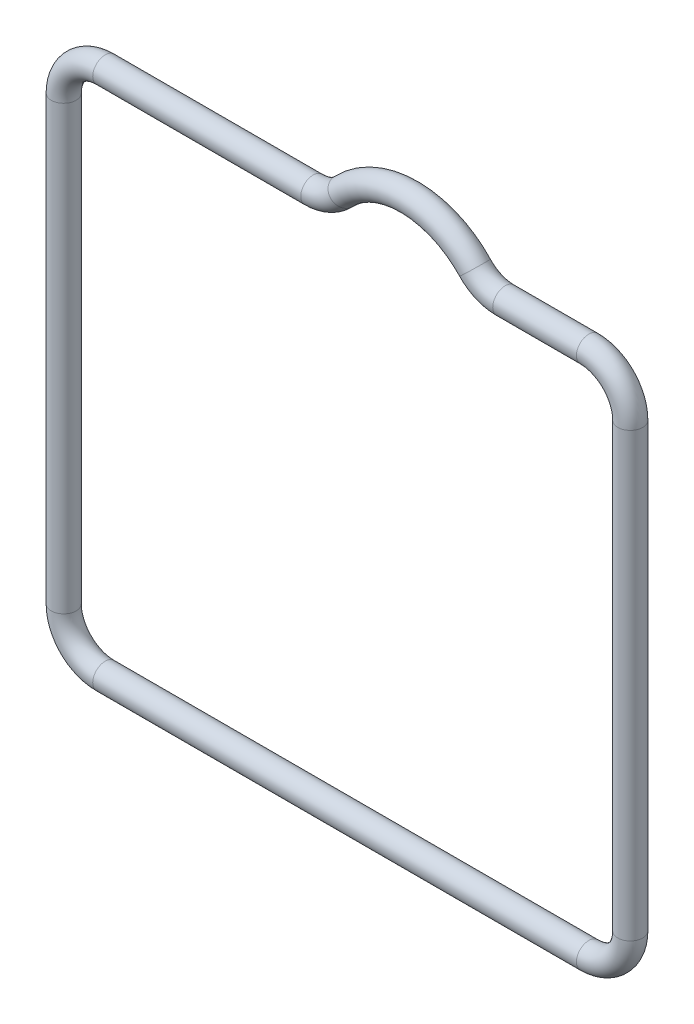
ISO-10303-21;
HEADER;
FILE_DESCRIPTION(('STEP AP214'),'2;1');
FILE_NAME('part.step','',(''),(''),'','','');
FILE_SCHEMA(('AUTOMOTIVE_DESIGN { 1 0 10303 214 1 1 1 1 }'));
ENDSEC;
DATA;
#1=APPLICATION_CONTEXT('core data for automotive mechanical design processes');
#2=APPLICATION_PROTOCOL_DEFINITION('international standard','automotive_design',2000,#1);
#3=PRODUCT_CONTEXT('',#1,'mechanical');
#4=PRODUCT('Part','Part','',(#3));
#5=PRODUCT_RELATED_PRODUCT_CATEGORY('part','',(#4));
#6=PRODUCT_DEFINITION_FORMATION('','',#4);
#7=PRODUCT_DEFINITION_CONTEXT('part definition',#1,'design');
#8=PRODUCT_DEFINITION('design','',#6,#7);
#9=PRODUCT_DEFINITION_SHAPE('','',#8);
#10=(LENGTH_UNIT() NAMED_UNIT(*) SI_UNIT(.MILLI.,.METRE.));
#11=(NAMED_UNIT(*) PLANE_ANGLE_UNIT() SI_UNIT($,.RADIAN.));
#12=(NAMED_UNIT(*) SI_UNIT($,.STERADIAN.) SOLID_ANGLE_UNIT());
#13=UNCERTAINTY_MEASURE_WITH_UNIT(LENGTH_MEASURE(1.E-05),#10,'distance_accuracy_value','');
#14=(GEOMETRIC_REPRESENTATION_CONTEXT(3) GLOBAL_UNCERTAINTY_ASSIGNED_CONTEXT((#13)) GLOBAL_UNIT_ASSIGNED_CONTEXT((#10,
#11,#12)) REPRESENTATION_CONTEXT('',''));
#15=CARTESIAN_POINT('',(0.,0.,0.));
#16=DIRECTION('',(0.,0.,1.));
#17=DIRECTION('',(1.,0.,0.));
#18=AXIS2_PLACEMENT_3D('',#15,#16,#17);
#19=CARTESIAN_POINT('',(3.,3.,0.));
#20=DIRECTION('',(0.,0.,-1.));
#21=DIRECTION('',(-1.,0.,0.));
#22=AXIS2_PLACEMENT_3D('',#19,#20,#21);
#23=TOROIDAL_SURFACE('',#22,3.,0.9);
#24=CARTESIAN_POINT('',(3.00000000000002,0.,0.));
#25=DIRECTION('',(-1.,0.,0.));
#26=DIRECTION('',(0.,0.,1.));
#27=AXIS2_PLACEMENT_3D('',#24,#25,#26);
#28=CIRCLE('',#27,0.9);
#29=CARTESIAN_POINT('',(3.00000000000003,-0.9,0.));
#30=VERTEX_POINT('',#29);
#31=EDGE_CURVE('E12',#30,#30,#28,.T.);
#32=CARTESIAN_POINT('',(0.,3.00000000000002,0.));
#33=DIRECTION('',(0.,1.,0.));
#34=DIRECTION('',(0.,0.,1.));
#35=AXIS2_PLACEMENT_3D('',#32,#33,#34);
#36=CIRCLE('',#35,0.9);
#37=CARTESIAN_POINT('',(-0.9,3.00000000000003,0.));
#38=VERTEX_POINT('',#37);
#39=EDGE_CURVE('E82',#38,#38,#36,.T.);
#40=CARTESIAN_POINT('',(3.,3.,0.));
#41=DIRECTION('',(0.,0.,-1.));
#42=DIRECTION('',(-1.,0.,0.));
#43=AXIS2_PLACEMENT_3D('',#40,#41,#42);
#44=CIRCLE('',#43,3.9);
#45=EDGE_CURVE('',#30,#38,#44,.T.);
#46=ORIENTED_EDGE('',*,*,#31,.T.);
#47=ORIENTED_EDGE('',*,*,#39,.F.);
#48=ORIENTED_EDGE('',*,*,#45,.T.);
#49=ORIENTED_EDGE('',*,*,#45,.F.);
#50=EDGE_LOOP('',(#46,#48,#47,#49));
#51=FACE_BOUND('',#50,.T.);
#52=ADVANCED_FACE('F42',(#51),#23,.T.);
#53=CARTESIAN_POINT('',(38.,0.,0.));
#54=DIRECTION('',(-1.,0.,0.));
#55=DIRECTION('',(0.,0.,1.));
#56=AXIS2_PLACEMENT_3D('',#53,#54,#55);
#57=CYLINDRICAL_SURFACE('',#56,0.9);
#58=ORIENTED_EDGE('',*,*,#31,.F.);
#59=EDGE_LOOP('',(#58));
#60=FACE_BOUND('',#59,.T.);
#61=CARTESIAN_POINT('',(38.,0.,0.));
#62=DIRECTION('',(-1.,0.,0.));
#63=DIRECTION('',(0.,0.,1.));
#64=AXIS2_PLACEMENT_3D('',#61,#62,#63);
#65=CIRCLE('',#64,0.9);
#66=CARTESIAN_POINT('',(38.,-0.900000000000002,0.));
#67=VERTEX_POINT('',#66);
#68=EDGE_CURVE('E48',#67,#67,#65,.T.);
#69=ORIENTED_EDGE('',*,*,#68,.T.);
#70=EDGE_LOOP('',(#69));
#71=FACE_BOUND('',#70,.T.);
#72=ADVANCED_FACE('F89',(#60,#71),#57,.T.);
#73=CARTESIAN_POINT('',(38.,3.,0.));
#74=DIRECTION('',(0.,0.,-1.));
#75=DIRECTION('',(-1.,0.,0.));
#76=AXIS2_PLACEMENT_3D('',#73,#74,#75);
#77=TOROIDAL_SURFACE('',#76,3.,0.9);
#78=CARTESIAN_POINT('',(41.,3.00000000000002,0.));
#79=DIRECTION('',(0.,-1.,0.));
#80=DIRECTION('',(0.,0.,1.));
#81=AXIS2_PLACEMENT_3D('',#78,#79,#80);
#82=CIRCLE('',#81,0.9);
#83=CARTESIAN_POINT('',(41.9,3.00000000000003,0.));
#84=VERTEX_POINT('',#83);
#85=EDGE_CURVE('E52',#84,#84,#82,.T.);
#86=CARTESIAN_POINT('',(38.,3.,0.));
#87=DIRECTION('',(0.,0.,-1.));
#88=DIRECTION('',(-1.,0.,0.));
#89=AXIS2_PLACEMENT_3D('',#86,#87,#88);
#90=CIRCLE('',#89,3.9);
#91=EDGE_CURVE('',#84,#67,#90,.T.);
#92=ORIENTED_EDGE('',*,*,#85,.T.);
#93=ORIENTED_EDGE('',*,*,#68,.F.);
#94=ORIENTED_EDGE('',*,*,#91,.T.);
#95=ORIENTED_EDGE('',*,*,#91,.F.);
#96=EDGE_LOOP('',(#92,#94,#93,#95));
#97=FACE_BOUND('',#96,.T.);
#98=ADVANCED_FACE('F93',(#97),#77,.T.);
#99=CARTESIAN_POINT('',(41.,35.,0.));
#100=DIRECTION('',(0.,-1.,0.));
#101=DIRECTION('',(0.,0.,-1.));
#102=AXIS2_PLACEMENT_3D('',#99,#100,#101);
#103=CYLINDRICAL_SURFACE('',#102,0.9);
#104=ORIENTED_EDGE('',*,*,#85,.F.);
#105=EDGE_LOOP('',(#104));
#106=FACE_BOUND('',#105,.T.);
#107=CARTESIAN_POINT('',(41.,35.,0.));
#108=DIRECTION('',(0.,-1.,0.));
#109=DIRECTION('',(0.,0.,1.));
#110=AXIS2_PLACEMENT_3D('',#107,#108,#109);
#111=CIRCLE('',#110,0.9);
#112=CARTESIAN_POINT('',(41.9,35.,0.));
#113=VERTEX_POINT('',#112);
#114=EDGE_CURVE('E56',#113,#113,#111,.T.);
#115=ORIENTED_EDGE('',*,*,#114,.T.);
#116=EDGE_LOOP('',(#115));
#117=FACE_BOUND('',#116,.T.);
#118=ADVANCED_FACE('F98',(#106,#117),#103,.T.);
#119=CARTESIAN_POINT('',(38.,35.,0.));
#120=DIRECTION('',(0.,0.,-1.));
#121=DIRECTION('',(-1.,0.,0.));
#122=AXIS2_PLACEMENT_3D('',#119,#120,#121);
#123=TOROIDAL_SURFACE('',#122,3.,0.9);
#124=CARTESIAN_POINT('',(38.,38.,0.));
#125=DIRECTION('',(1.,0.,0.));
#126=DIRECTION('',(0.,0.,1.));
#127=AXIS2_PLACEMENT_3D('',#124,#125,#126);
#128=CIRCLE('',#127,0.9);
#129=CARTESIAN_POINT('',(38.,38.9,0.));
#130=VERTEX_POINT('',#129);
#131=EDGE_CURVE('E61',#130,#130,#128,.T.);
#132=CARTESIAN_POINT('',(38.,35.,0.));
#133=DIRECTION('',(0.,0.,-1.));
#134=DIRECTION('',(-1.,0.,0.));
#135=AXIS2_PLACEMENT_3D('',#132,#133,#134);
#136=CIRCLE('',#135,3.9);
#137=EDGE_CURVE('',#130,#113,#136,.T.);
#138=ORIENTED_EDGE('',*,*,#131,.T.);
#139=ORIENTED_EDGE('',*,*,#114,.F.);
#140=ORIENTED_EDGE('',*,*,#137,.T.);
#141=ORIENTED_EDGE('',*,*,#137,.F.);
#142=EDGE_LOOP('',(#138,#140,#139,#141));
#143=FACE_BOUND('',#142,.T.);
#144=ADVANCED_FACE('F104',(#143),#123,.T.);
#145=CARTESIAN_POINT('',(31.9462219947249,38.,0.));
#146=DIRECTION('',(1.,0.,0.));
#147=DIRECTION('',(0.,0.,-1.));
#148=AXIS2_PLACEMENT_3D('',#145,#146,#147);
#149=CYLINDRICAL_SURFACE('',#148,0.9);
#150=ORIENTED_EDGE('',*,*,#131,.F.);
#151=EDGE_LOOP('',(#150));
#152=FACE_BOUND('',#151,.T.);
#153=CARTESIAN_POINT('',(31.9462219947249,38.,0.));
#154=DIRECTION('',(1.,0.,0.));
#155=DIRECTION('',(0.,0.,1.));
#156=AXIS2_PLACEMENT_3D('',#153,#154,#155);
#157=CIRCLE('',#156,0.9);
#158=CARTESIAN_POINT('',(31.9462219947249,37.1,0.));
#159=VERTEX_POINT('',#158);
#160=EDGE_CURVE('E64',#159,#159,#157,.T.);
#161=ORIENTED_EDGE('',*,*,#160,.T.);
#162=EDGE_LOOP('',(#161));
#163=FACE_BOUND('',#162,.T.);
#164=ADVANCED_FACE('F108',(#152,#163),#149,.T.);
#165=CARTESIAN_POINT('',(31.9462219947249,41.,0.));
#166=DIRECTION('',(0.,0.,1.));
#167=DIRECTION('',(1.,0.,0.));
#168=AXIS2_PLACEMENT_3D('',#165,#166,#167);
#169=TOROIDAL_SURFACE('',#168,3.,0.9);
#170=CARTESIAN_POINT('',(29.7622570007503,38.943231441048,0.));
#171=DIRECTION('',(0.685589519650656,-0.72798833132488,0.));
#172=DIRECTION('',(0.,0.,1.));
#173=AXIS2_PLACEMENT_3D('',#170,#171,#172);
#174=CIRCLE('',#173,0.9);
#175=CARTESIAN_POINT('',(29.1070675025579,38.3262008733624,0.));
#176=VERTEX_POINT('',#175);
#177=EDGE_CURVE('E67',#176,#176,#174,.T.);
#178=CARTESIAN_POINT('',(31.9462219947249,41.,0.));
#179=DIRECTION('',(0.,0.,1.));
#180=DIRECTION('',(1.,0.,0.));
#181=AXIS2_PLACEMENT_3D('',#178,#179,#180);
#182=CIRCLE('',#181,3.9);
#183=EDGE_CURVE('',#176,#159,#182,.T.);
#184=ORIENTED_EDGE('',*,*,#177,.T.);
#185=ORIENTED_EDGE('',*,*,#160,.F.);
#186=ORIENTED_EDGE('',*,*,#183,.T.);
#187=ORIENTED_EDGE('',*,*,#183,.F.);
#188=EDGE_LOOP('',(#184,#186,#185,#187));
#189=FACE_BOUND('',#188,.T.);
#190=ADVANCED_FACE('F112',(#189),#169,.T.);
#191=CARTESIAN_POINT('',(25.,34.4583333333333,0.));
#192=DIRECTION('',(0.,0.,-1.));
#193=DIRECTION('',(-1.,0.,0.));
#194=AXIS2_PLACEMENT_3D('',#191,#192,#193);
#195=TOROIDAL_SURFACE('',#194,6.54166666666667,0.9);
#196=ORIENTED_EDGE('',*,*,#177,.F.);
#197=EDGE_LOOP('',(#196));
#198=FACE_BOUND('',#197,.T.);
#199=CARTESIAN_POINT('',(20.2377429992497,38.943231441048,0.));
#200=DIRECTION('',(0.685589519650656,0.72798833132488,0.));
#201=DIRECTION('',(0.,0.,1.));
#202=AXIS2_PLACEMENT_3D('',#199,#200,#201);
#203=CIRCLE('',#202,0.9);
#204=CARTESIAN_POINT('',(20.8929324974421,38.3262008733624,0.));
#205=VERTEX_POINT('',#204);
#206=EDGE_CURVE('E70',#205,#205,#203,.T.);
#207=ORIENTED_EDGE('',*,*,#206,.T.);
#208=EDGE_LOOP('',(#207));
#209=FACE_BOUND('',#208,.T.);
#210=ADVANCED_FACE('F116',(#198,#209),#195,.T.);
#211=CARTESIAN_POINT('',(18.0537780052751,41.,0.));
#212=DIRECTION('',(0.,0.,1.));
#213=DIRECTION('',(1.,0.,0.));
#214=AXIS2_PLACEMENT_3D('',#211,#212,#213);
#215=TOROIDAL_SURFACE('',#214,3.,0.9);
#216=CARTESIAN_POINT('',(18.0537780052751,38.,0.));
#217=DIRECTION('',(1.,0.,0.));
#218=DIRECTION('',(0.,0.,1.));
#219=AXIS2_PLACEMENT_3D('',#216,#217,#218);
#220=CIRCLE('',#219,0.9);
#221=CARTESIAN_POINT('',(18.0537780052751,37.1,0.));
#222=VERTEX_POINT('',#221);
#223=EDGE_CURVE('E73',#222,#222,#220,.T.);
#224=CARTESIAN_POINT('',(18.0537780052751,41.,0.));
#225=DIRECTION('',(0.,0.,1.));
#226=DIRECTION('',(1.,0.,0.));
#227=AXIS2_PLACEMENT_3D('',#224,#225,#226);
#228=CIRCLE('',#227,3.9);
#229=EDGE_CURVE('',#222,#205,#228,.T.);
#230=ORIENTED_EDGE('',*,*,#223,.T.);
#231=ORIENTED_EDGE('',*,*,#206,.F.);
#232=ORIENTED_EDGE('',*,*,#229,.T.);
#233=ORIENTED_EDGE('',*,*,#229,.F.);
#234=EDGE_LOOP('',(#230,#232,#231,#233));
#235=FACE_BOUND('',#234,.T.);
#236=ADVANCED_FACE('F120',(#235),#215,.T.);
#237=CARTESIAN_POINT('',(3.00000000000002,38.,0.));
#238=DIRECTION('',(1.,0.,0.));
#239=DIRECTION('',(0.,0.,-1.));
#240=AXIS2_PLACEMENT_3D('',#237,#238,#239);
#241=CYLINDRICAL_SURFACE('',#240,0.9);
#242=ORIENTED_EDGE('',*,*,#223,.F.);
#243=EDGE_LOOP('',(#242));
#244=FACE_BOUND('',#243,.T.);
#245=CARTESIAN_POINT('',(3.00000000000002,38.,0.));
#246=DIRECTION('',(1.,0.,0.));
#247=DIRECTION('',(0.,0.,1.));
#248=AXIS2_PLACEMENT_3D('',#245,#246,#247);
#249=CIRCLE('',#248,0.9);
#250=CARTESIAN_POINT('',(3.00000000000003,38.9,0.));
#251=VERTEX_POINT('',#250);
#252=EDGE_CURVE('E76',#251,#251,#249,.T.);
#253=ORIENTED_EDGE('',*,*,#252,.T.);
#254=EDGE_LOOP('',(#253));
#255=FACE_BOUND('',#254,.T.);
#256=ADVANCED_FACE('F124',(#244,#255),#241,.T.);
#257=CARTESIAN_POINT('',(3.,35.,0.));
#258=DIRECTION('',(0.,0.,-1.));
#259=DIRECTION('',(-1.,0.,0.));
#260=AXIS2_PLACEMENT_3D('',#257,#258,#259);
#261=TOROIDAL_SURFACE('',#260,2.99999999999998,0.9);
#262=CARTESIAN_POINT('',(0.,35.,0.));
#263=DIRECTION('',(0.,1.,0.));
#264=DIRECTION('',(0.,0.,1.));
#265=AXIS2_PLACEMENT_3D('',#262,#263,#264);
#266=CIRCLE('',#265,0.9);
#267=CARTESIAN_POINT('',(-0.899999999999981,35.,0.));
#268=VERTEX_POINT('',#267);
#269=EDGE_CURVE('E79',#268,#268,#266,.T.);
#270=CARTESIAN_POINT('',(3.,35.,0.));
#271=DIRECTION('',(0.,0.,-1.));
#272=DIRECTION('',(-1.,0.,0.));
#273=AXIS2_PLACEMENT_3D('',#270,#271,#272);
#274=CIRCLE('',#273,3.89999999999998);
#275=EDGE_CURVE('',#268,#251,#274,.T.);
#276=ORIENTED_EDGE('',*,*,#269,.T.);
#277=ORIENTED_EDGE('',*,*,#252,.F.);
#278=ORIENTED_EDGE('',*,*,#275,.T.);
#279=ORIENTED_EDGE('',*,*,#275,.F.);
#280=EDGE_LOOP('',(#276,#278,#277,#279));
#281=FACE_BOUND('',#280,.T.);
#282=ADVANCED_FACE('F128',(#281),#261,.T.);
#283=CARTESIAN_POINT('',(0.,3.00000000000002,0.));
#284=DIRECTION('',(0.,1.,0.));
#285=DIRECTION('',(0.,0.,1.));
#286=AXIS2_PLACEMENT_3D('',#283,#284,#285);
#287=CYLINDRICAL_SURFACE('',#286,0.9);
#288=ORIENTED_EDGE('',*,*,#269,.F.);
#289=EDGE_LOOP('',(#288));
#290=FACE_BOUND('',#289,.T.);
#291=ORIENTED_EDGE('',*,*,#39,.T.);
#292=EDGE_LOOP('',(#291));
#293=FACE_BOUND('',#292,.T.);
#294=ADVANCED_FACE('F86',(#290,#293),#287,.T.);
#295=CLOSED_SHELL('',(#52,#72,#98,#118,#144,#164,#190,#210,#236,#256,#282,#294));
#296=MANIFOLD_SOLID_BREP('B2',#295);
#297=ADVANCED_BREP_SHAPE_REPRESENTATION('',(#18,#296),#14);
#298=SHAPE_DEFINITION_REPRESENTATION(#9,#297);
ENDSEC;
END-ISO-10303-21;
